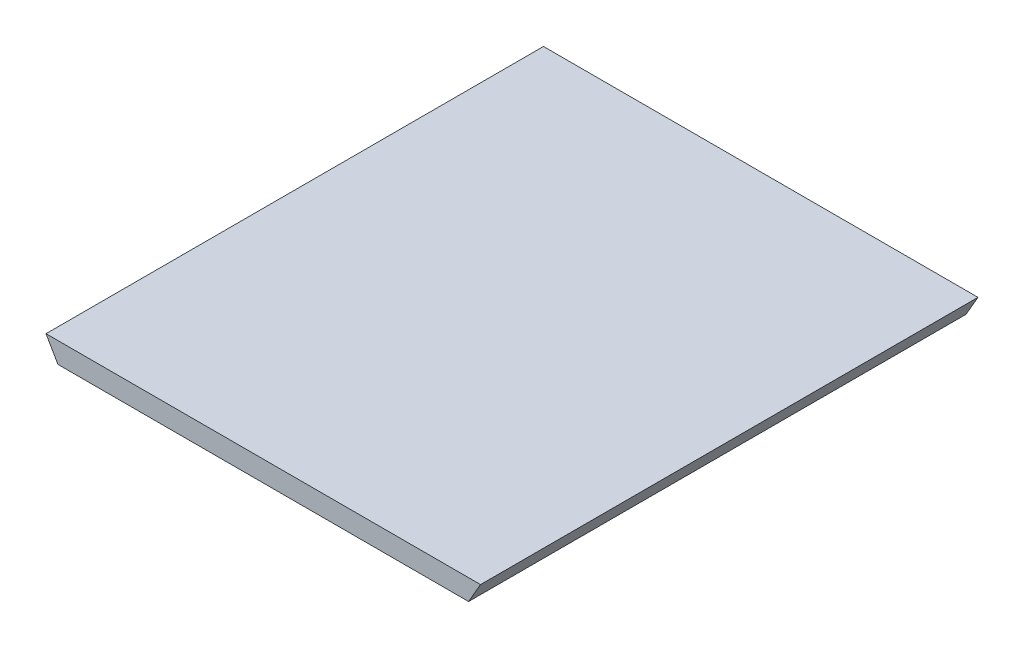
ISO-10303-21;
HEADER;
FILE_DESCRIPTION(('STEP AP214'),'2;1');
FILE_NAME('part.step','',(''),(''),'','','');
FILE_SCHEMA(('AUTOMOTIVE_DESIGN { 1 0 10303 214 1 1 1 1 }'));
ENDSEC;
DATA;
#1=APPLICATION_CONTEXT('core data for automotive mechanical design processes');
#2=APPLICATION_PROTOCOL_DEFINITION('international standard','automotive_design',2000,#1);
#3=PRODUCT_CONTEXT('',#1,'mechanical');
#4=PRODUCT('Part','Part','',(#3));
#5=PRODUCT_RELATED_PRODUCT_CATEGORY('part','',(#4));
#6=PRODUCT_DEFINITION_FORMATION('','',#4);
#7=PRODUCT_DEFINITION_CONTEXT('part definition',#1,'design');
#8=PRODUCT_DEFINITION('design','',#6,#7);
#9=PRODUCT_DEFINITION_SHAPE('','',#8);
#10=(LENGTH_UNIT() NAMED_UNIT(*) SI_UNIT(.MILLI.,.METRE.));
#11=(NAMED_UNIT(*) PLANE_ANGLE_UNIT() SI_UNIT($,.RADIAN.));
#12=(NAMED_UNIT(*) SI_UNIT($,.STERADIAN.) SOLID_ANGLE_UNIT());
#13=UNCERTAINTY_MEASURE_WITH_UNIT(LENGTH_MEASURE(1.E-05),#10,'distance_accuracy_value','');
#14=(GEOMETRIC_REPRESENTATION_CONTEXT(3) GLOBAL_UNCERTAINTY_ASSIGNED_CONTEXT((#13)) GLOBAL_UNIT_ASSIGNED_CONTEXT((#10,
#11,#12)) REPRESENTATION_CONTEXT('',''));
#15=CARTESIAN_POINT('',(0.,0.,0.));
#16=DIRECTION('',(0.,0.,1.));
#17=DIRECTION('',(1.,0.,0.));
#18=AXIS2_PLACEMENT_3D('',#15,#16,#17);
#19=CARTESIAN_POINT('',(-15.7660254037844,1.5,36.1));
#20=DIRECTION('',(0.86602540378444,0.499999999999998,0.));
#21=DIRECTION('',(-0.499999999999998,0.86602540378444,0.));
#22=AXIS2_PLACEMENT_3D('',#19,#20,#21);
#23=PLANE('',#22);
#24=DIRECTION('',(0.499999999999998,-0.86602540378444,0.));
#25=VECTOR('',#24,1.);
#26=CARTESIAN_POINT('',(-15.7660254037844,1.5,0.));
#27=LINE('',#26,#25);
#28=CARTESIAN_POINT('',(-15.7660254037844,1.5,0.));
#29=VERTEX_POINT('',#28);
#30=CARTESIAN_POINT('',(-14.9,0.,0.));
#31=VERTEX_POINT('',#30);
#32=EDGE_CURVE('E101',#29,#31,#27,.T.);
#33=ORIENTED_EDGE('',*,*,#32,.T.);
#34=DIRECTION('',(0.,0.,-1.));
#35=VECTOR('',#34,1.);
#36=CARTESIAN_POINT('',(-14.9,0.,36.1));
#37=LINE('',#36,#35);
#38=CARTESIAN_POINT('',(-14.9,0.,36.1));
#39=VERTEX_POINT('',#38);
#40=EDGE_CURVE('E11',#39,#31,#37,.T.);
#41=ORIENTED_EDGE('',*,*,#40,.F.);
#42=DIRECTION('',(0.499999999999998,-0.86602540378444,0.));
#43=VECTOR('',#42,1.);
#44=CARTESIAN_POINT('',(-15.7660254037844,1.5,36.1));
#45=LINE('',#44,#43);
#46=CARTESIAN_POINT('',(-15.7660254037844,1.5,36.1));
#47=VERTEX_POINT('',#46);
#48=EDGE_CURVE('E89',#47,#39,#45,.T.);
#49=ORIENTED_EDGE('',*,*,#48,.F.);
#50=DIRECTION('',(0.,0.,-1.));
#51=VECTOR('',#50,1.);
#52=CARTESIAN_POINT('',(-15.7660254037844,1.5,36.1));
#53=LINE('',#52,#51);
#54=EDGE_CURVE('E97',#47,#29,#53,.T.);
#55=ORIENTED_EDGE('',*,*,#54,.T.);
#56=EDGE_LOOP('',(#33,#41,#49,#55));
#57=FACE_BOUND('',#56,.T.);
#58=ADVANCED_FACE('F38',(#57),#23,.F.);
#59=CARTESIAN_POINT('',(-14.9,0.,36.1));
#60=DIRECTION('',(0.,1.,0.));
#61=DIRECTION('',(-1.,0.,0.));
#62=AXIS2_PLACEMENT_3D('',#59,#60,#61);
#63=PLANE('',#62);
#64=DIRECTION('',(1.,0.,0.));
#65=VECTOR('',#64,1.);
#66=CARTESIAN_POINT('',(-14.9,0.,0.));
#67=LINE('',#66,#65);
#68=CARTESIAN_POINT('',(14.9,0.,0.));
#69=VERTEX_POINT('',#68);
#70=EDGE_CURVE('E93',#31,#69,#67,.T.);
#71=ORIENTED_EDGE('',*,*,#70,.T.);
#72=DIRECTION('',(0.,0.,-1.));
#73=VECTOR('',#72,1.);
#74=CARTESIAN_POINT('',(14.9,0.,36.1));
#75=LINE('',#74,#73);
#76=CARTESIAN_POINT('',(14.9,0.,36.1));
#77=VERTEX_POINT('',#76);
#78=EDGE_CURVE('E46',#77,#69,#75,.T.);
#79=ORIENTED_EDGE('',*,*,#78,.F.);
#80=DIRECTION('',(1.,0.,0.));
#81=VECTOR('',#80,1.);
#82=CARTESIAN_POINT('',(-14.9,0.,36.1));
#83=LINE('',#82,#81);
#84=EDGE_CURVE('E84',#39,#77,#83,.T.);
#85=ORIENTED_EDGE('',*,*,#84,.F.);
#86=ORIENTED_EDGE('',*,*,#40,.T.);
#87=EDGE_LOOP('',(#71,#79,#85,#86));
#88=FACE_BOUND('',#87,.T.);
#89=ADVANCED_FACE('F92',(#88),#63,.F.);
#90=CARTESIAN_POINT('',(14.9,0.,36.1));
#91=DIRECTION('',(-0.866025403784439,0.499999999999999,0.));
#92=DIRECTION('',(-0.499999999999999,-0.86602540378444,0.));
#93=AXIS2_PLACEMENT_3D('',#90,#91,#92);
#94=PLANE('',#93);
#95=DIRECTION('',(0.499999999999999,0.866025403784439,0.));
#96=VECTOR('',#95,1.);
#97=CARTESIAN_POINT('',(14.9,0.,0.));
#98=LINE('',#97,#96);
#99=CARTESIAN_POINT('',(15.7660254037844,1.5,0.));
#100=VERTEX_POINT('',#99);
#101=EDGE_CURVE('E71',#69,#100,#98,.T.);
#102=ORIENTED_EDGE('',*,*,#101,.T.);
#103=DIRECTION('',(0.,0.,-1.));
#104=VECTOR('',#103,1.);
#105=CARTESIAN_POINT('',(15.7660254037844,1.5,36.1));
#106=LINE('',#105,#104);
#107=CARTESIAN_POINT('',(15.7660254037844,1.5,36.1));
#108=VERTEX_POINT('',#107);
#109=EDGE_CURVE('E94',#108,#100,#106,.T.);
#110=ORIENTED_EDGE('',*,*,#109,.F.);
#111=DIRECTION('',(0.499999999999999,0.866025403784439,0.));
#112=VECTOR('',#111,1.);
#113=CARTESIAN_POINT('',(14.9,0.,36.1));
#114=LINE('',#113,#112);
#115=EDGE_CURVE('E87',#77,#108,#114,.T.);
#116=ORIENTED_EDGE('',*,*,#115,.F.);
#117=ORIENTED_EDGE('',*,*,#78,.T.);
#118=EDGE_LOOP('',(#102,#110,#116,#117));
#119=FACE_BOUND('',#118,.T.);
#120=ADVANCED_FACE('F95',(#119),#94,.F.);
#121=CARTESIAN_POINT('',(15.7660254037844,1.5,36.1));
#122=DIRECTION('',(0.,-1.,0.));
#123=DIRECTION('',(1.,0.,0.));
#124=AXIS2_PLACEMENT_3D('',#121,#122,#123);
#125=PLANE('',#124);
#126=DIRECTION('',(-1.,0.,0.));
#127=VECTOR('',#126,1.);
#128=CARTESIAN_POINT('',(15.7660254037844,1.5,0.));
#129=LINE('',#128,#127);
#130=EDGE_CURVE('E77',#100,#29,#129,.T.);
#131=ORIENTED_EDGE('',*,*,#130,.T.);
#132=ORIENTED_EDGE('',*,*,#54,.F.);
#133=DIRECTION('',(-1.,0.,0.));
#134=VECTOR('',#133,1.);
#135=CARTESIAN_POINT('',(15.7660254037844,1.5,36.1));
#136=LINE('',#135,#134);
#137=EDGE_CURVE('E54',#108,#47,#136,.T.);
#138=ORIENTED_EDGE('',*,*,#137,.F.);
#139=ORIENTED_EDGE('',*,*,#109,.T.);
#140=EDGE_LOOP('',(#131,#132,#138,#139));
#141=FACE_BOUND('',#140,.T.);
#142=ADVANCED_FACE('F108',(#141),#125,.F.);
#143=CARTESIAN_POINT('',(0.,0.,36.1));
#144=DIRECTION('',(0.,0.,1.));
#145=DIRECTION('',(1.,0.,0.));
#146=AXIS2_PLACEMENT_3D('',#143,#144,#145);
#147=PLANE('',#146);
#148=ORIENTED_EDGE('',*,*,#48,.T.);
#149=ORIENTED_EDGE('',*,*,#84,.T.);
#150=ORIENTED_EDGE('',*,*,#115,.T.);
#151=ORIENTED_EDGE('',*,*,#137,.T.);
#152=EDGE_LOOP('',(#148,#149,#150,#151));
#153=FACE_BOUND('',#152,.T.);
#154=ADVANCED_FACE('F85',(#153),#147,.T.);
#155=CARTESIAN_POINT('',(0.,0.,0.));
#156=DIRECTION('',(0.,0.,1.));
#157=DIRECTION('',(1.,0.,0.));
#158=AXIS2_PLACEMENT_3D('',#155,#156,#157);
#159=PLANE('',#158);
#160=ORIENTED_EDGE('',*,*,#32,.F.);
#161=ORIENTED_EDGE('',*,*,#130,.F.);
#162=ORIENTED_EDGE('',*,*,#101,.F.);
#163=ORIENTED_EDGE('',*,*,#70,.F.);
#164=EDGE_LOOP('',(#160,#161,#162,#163));
#165=FACE_BOUND('',#164,.T.);
#166=ADVANCED_FACE('F111',(#165),#159,.F.);
#167=CLOSED_SHELL('',(#58,#89,#120,#142,#154,#166));
#168=MANIFOLD_SOLID_BREP('B2',#167);
#169=ADVANCED_BREP_SHAPE_REPRESENTATION('',(#18,#168),#14);
#170=SHAPE_DEFINITION_REPRESENTATION(#9,#169);
ENDSEC;
END-ISO-10303-21;
